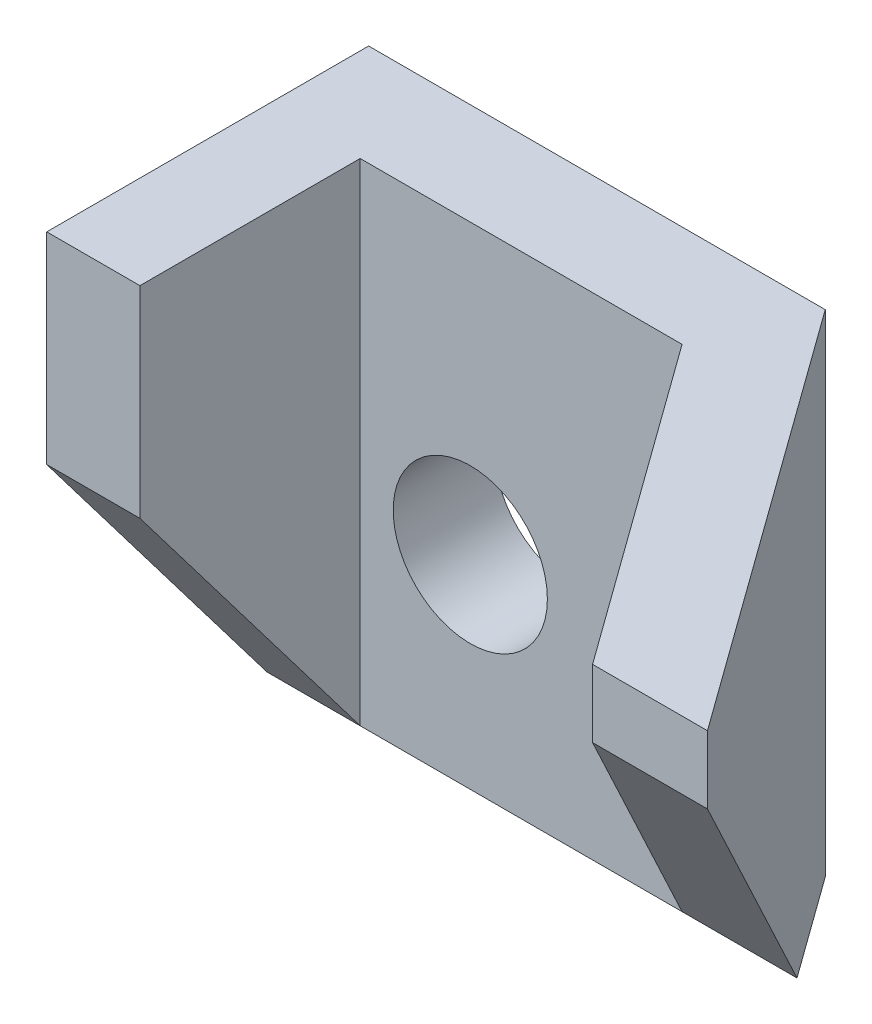
ISO-10303-21;
HEADER;
FILE_DESCRIPTION(('STEP AP214'),'2;1');
FILE_NAME('part.step','',(''),(''),'','','');
FILE_SCHEMA(('AUTOMOTIVE_DESIGN { 1 0 10303 214 1 1 1 1 }'));
ENDSEC;
DATA;
#1=APPLICATION_CONTEXT('core data for automotive mechanical design processes');
#2=APPLICATION_PROTOCOL_DEFINITION('international standard','automotive_design',2000,#1);
#3=PRODUCT_CONTEXT('',#1,'mechanical');
#4=PRODUCT('Part','Part','',(#3));
#5=PRODUCT_RELATED_PRODUCT_CATEGORY('part','',(#4));
#6=PRODUCT_DEFINITION_FORMATION('','',#4);
#7=PRODUCT_DEFINITION_CONTEXT('part definition',#1,'design');
#8=PRODUCT_DEFINITION('design','',#6,#7);
#9=PRODUCT_DEFINITION_SHAPE('','',#8);
#10=(LENGTH_UNIT() NAMED_UNIT(*) SI_UNIT(.MILLI.,.METRE.));
#11=(NAMED_UNIT(*) PLANE_ANGLE_UNIT() SI_UNIT($,.RADIAN.));
#12=(NAMED_UNIT(*) SI_UNIT($,.STERADIAN.) SOLID_ANGLE_UNIT());
#13=UNCERTAINTY_MEASURE_WITH_UNIT(LENGTH_MEASURE(1.E-05),#10,'distance_accuracy_value','');
#14=(GEOMETRIC_REPRESENTATION_CONTEXT(3) GLOBAL_UNCERTAINTY_ASSIGNED_CONTEXT((#13)) GLOBAL_UNIT_ASSIGNED_CONTEXT((#10,
#11,#12)) REPRESENTATION_CONTEXT('',''));
#15=CARTESIAN_POINT('',(0.,0.,0.));
#16=DIRECTION('',(0.,0.,1.));
#17=DIRECTION('',(1.,0.,0.));
#18=AXIS2_PLACEMENT_3D('',#15,#16,#17);
#19=CARTESIAN_POINT('',(0.,-12.,25.));
#20=DIRECTION('',(0.,-1.,0.));
#21=DIRECTION('',(1.,0.,0.));
#22=AXIS2_PLACEMENT_3D('',#19,#20,#21);
#23=PLANE('',#22);
#24=DIRECTION('',(0.,0.,-1.));
#25=VECTOR('',#24,1.);
#26=CARTESIAN_POINT('',(-12.,-12.,25.));
#27=LINE('',#26,#25);
#28=CARTESIAN_POINT('',(-12.,-12.,6.));
#29=VERTEX_POINT('',#28);
#30=CARTESIAN_POINT('',(-12.,-12.,0.));
#31=VERTEX_POINT('',#30);
#32=EDGE_CURVE('E11',#29,#31,#27,.T.);
#33=ORIENTED_EDGE('',*,*,#32,.T.);
#34=DIRECTION('',(1.,0.,0.));
#35=VECTOR('',#34,1.);
#36=CARTESIAN_POINT('',(0.,-12.,0.));
#37=LINE('',#36,#35);
#38=CARTESIAN_POINT('',(14.9519339128112,-12.,0.));
#39=VERTEX_POINT('',#38);
#40=EDGE_CURVE('E131',#31,#39,#37,.T.);
#41=ORIENTED_EDGE('',*,*,#40,.T.);
#42=DIRECTION('',(-0.585330910525227,0.,-0.810794502438015));
#43=VECTOR('',#42,1.);
#44=CARTESIAN_POINT('',(9.82921782204009,-12.,-7.09593491350215));
#45=LINE('',#44,#43);
#46=CARTESIAN_POINT('',(19.2834697737365,-12.,6.));
#47=VERTEX_POINT('',#46);
#48=EDGE_CURVE('E112',#47,#39,#45,.T.);
#49=ORIENTED_EDGE('',*,*,#48,.F.);
#50=DIRECTION('',(1.,0.,0.));
#51=VECTOR('',#50,1.);
#52=CARTESIAN_POINT('',(-43.4006369362152,-12.,6.));
#53=LINE('',#52,#51);
#54=CARTESIAN_POINT('',(12.5,-12.,6.));
#55=VERTEX_POINT('',#54);
#56=EDGE_CURVE('E121',#55,#47,#53,.T.);
#57=ORIENTED_EDGE('',*,*,#56,.F.);
#58=DIRECTION('',(1.,0.,0.));
#59=VECTOR('',#58,1.);
#60=CARTESIAN_POINT('',(0.,-12.,6.));
#61=LINE('',#60,#59);
#62=CARTESIAN_POINT('',(-6.49999999999999,-12.,6.));
#63=VERTEX_POINT('',#62);
#64=EDGE_CURVE('E187',#63,#55,#61,.T.);
#65=ORIENTED_EDGE('',*,*,#64,.F.);
#66=EDGE_CURVE('E127',#29,#63,#53,.T.);
#67=ORIENTED_EDGE('',*,*,#66,.F.);
#68=EDGE_LOOP('',(#33,#41,#49,#57,#65,#67));
#69=FACE_BOUND('',#68,.T.);
#70=ADVANCED_FACE('F36',(#69),#23,.T.);
#71=CARTESIAN_POINT('',(-12.,-12.,25.));
#72=DIRECTION('',(-1.,0.,0.));
#73=DIRECTION('',(0.,0.,-1.));
#74=AXIS2_PLACEMENT_3D('',#71,#72,#73);
#75=PLANE('',#74);
#76=DIRECTION('',(0.,1.,0.));
#77=VECTOR('',#76,1.);
#78=CARTESIAN_POINT('',(-12.,-12.,19.));
#79=LINE('',#78,#77);
#80=CARTESIAN_POINT('',(-12.,5.10526315789474,19.));
#81=VERTEX_POINT('',#80);
#82=CARTESIAN_POINT('',(-12.,17.,19.));
#83=VERTEX_POINT('',#82);
#84=EDGE_CURVE('E162',#81,#83,#79,.T.);
#85=ORIENTED_EDGE('',*,*,#84,.T.);
#86=DIRECTION('',(0.,0.,-1.));
#87=VECTOR('',#86,1.);
#88=CARTESIAN_POINT('',(-12.,17.,25.));
#89=LINE('',#88,#87);
#90=CARTESIAN_POINT('',(-12.,17.,0.));
#91=VERTEX_POINT('',#90);
#92=EDGE_CURVE('E45',#83,#91,#89,.T.);
#93=ORIENTED_EDGE('',*,*,#92,.T.);
#94=DIRECTION('',(0.,-1.,0.));
#95=VECTOR('',#94,1.);
#96=CARTESIAN_POINT('',(-12.,-12.,0.));
#97=LINE('',#96,#95);
#98=EDGE_CURVE('E152',#91,#31,#97,.T.);
#99=ORIENTED_EDGE('',*,*,#98,.T.);
#100=ORIENTED_EDGE('',*,*,#32,.F.);
#101=DIRECTION('',(0.,0.796162194123103,0.605083267533558));
#102=VECTOR('',#101,1.);
#103=CARTESIAN_POINT('',(-12.,-7.28397565922921,9.5841784989858));
#104=LINE('',#103,#102);
#105=EDGE_CURVE('E117',#29,#81,#104,.T.);
#106=ORIENTED_EDGE('',*,*,#105,.T.);
#107=EDGE_LOOP('',(#85,#93,#99,#100,#106));
#108=FACE_BOUND('',#107,.T.);
#109=ADVANCED_FACE('F158',(#108),#75,.T.);
#110=CARTESIAN_POINT('',(0.,0.,25.));
#111=DIRECTION('',(0.,0.,-1.));
#112=DIRECTION('',(1.,0.,0.));
#113=AXIS2_PLACEMENT_3D('',#110,#111,#112);
#114=PLANE('',#113);
#115=DIRECTION('',(1.,0.,0.));
#116=VECTOR('',#115,1.);
#117=CARTESIAN_POINT('',(-43.4006369362152,13.,25.));
#118=LINE('',#117,#116);
#119=CARTESIAN_POINT('',(26.2165302262635,13.,25.));
#120=VERTEX_POINT('',#119);
#121=CARTESIAN_POINT('',(33.,13.,25.));
#122=VERTEX_POINT('',#121);
#123=EDGE_CURVE('E128',#120,#122,#118,.T.);
#124=ORIENTED_EDGE('',*,*,#123,.T.);
#125=DIRECTION('',(0.,1.,0.));
#126=VECTOR('',#125,1.);
#127=CARTESIAN_POINT('',(33.,-12.,25.));
#128=LINE('',#127,#126);
#129=CARTESIAN_POINT('',(33.,17.,25.));
#130=VERTEX_POINT('',#129);
#131=EDGE_CURVE('E115',#122,#130,#128,.T.);
#132=ORIENTED_EDGE('',*,*,#131,.T.);
#133=DIRECTION('',(-1.,0.,0.));
#134=VECTOR('',#133,1.);
#135=CARTESIAN_POINT('',(33.,17.,25.));
#136=LINE('',#135,#134);
#137=CARTESIAN_POINT('',(26.2165302262635,17.,25.));
#138=VERTEX_POINT('',#137);
#139=EDGE_CURVE('E148',#130,#138,#136,.T.);
#140=ORIENTED_EDGE('',*,*,#139,.T.);
#141=DIRECTION('',(0.,1.,0.));
#142=VECTOR('',#141,1.);
#143=CARTESIAN_POINT('',(26.2165302262635,-12.,25.));
#144=LINE('',#143,#142);
#145=EDGE_CURVE('E178',#120,#138,#144,.T.);
#146=ORIENTED_EDGE('',*,*,#145,.F.);
#147=EDGE_LOOP('',(#124,#132,#140,#146));
#148=FACE_BOUND('',#147,.T.);
#149=ADVANCED_FACE('F201',(#148),#114,.F.);
#150=CARTESIAN_POINT('',(-6.49999999999999,-12.,0.));
#151=DIRECTION('',(-1.,0.,0.));
#152=DIRECTION('',(0.,-1.,0.));
#153=AXIS2_PLACEMENT_3D('',#150,#151,#152);
#154=PLANE('',#153);
#155=DIRECTION('',(0.,-0.796162194123103,-0.605083267533558));
#156=VECTOR('',#155,1.);
#157=CARTESIAN_POINT('',(-6.49999999999999,-14.8904665314402,3.80324543610548));
#158=LINE('',#157,#156);
#159=CARTESIAN_POINT('',(-6.49999999999999,5.10526315789474,19.));
#160=VERTEX_POINT('',#159);
#161=EDGE_CURVE('E193',#160,#63,#158,.T.);
#162=ORIENTED_EDGE('',*,*,#161,.T.);
#163=DIRECTION('',(0.,1.,0.));
#164=VECTOR('',#163,1.);
#165=CARTESIAN_POINT('',(-6.49999999999999,-12.,6.));
#166=LINE('',#165,#164);
#167=CARTESIAN_POINT('',(-6.5,17.,6.));
#168=VERTEX_POINT('',#167);
#169=EDGE_CURVE('E137',#63,#168,#166,.T.);
#170=ORIENTED_EDGE('',*,*,#169,.T.);
#171=DIRECTION('',(0.,0.,-1.));
#172=VECTOR('',#171,1.);
#173=CARTESIAN_POINT('',(-6.5,17.,0.));
#174=LINE('',#173,#172);
#175=CARTESIAN_POINT('',(-6.5,17.,19.));
#176=VERTEX_POINT('',#175);
#177=EDGE_CURVE('E185',#176,#168,#174,.T.);
#178=ORIENTED_EDGE('',*,*,#177,.F.);
#179=DIRECTION('',(0.,1.,0.));
#180=VECTOR('',#179,1.);
#181=CARTESIAN_POINT('',(-6.49999999999999,-12.,19.));
#182=LINE('',#181,#180);
#183=EDGE_CURVE('E177',#160,#176,#182,.T.);
#184=ORIENTED_EDGE('',*,*,#183,.F.);
#185=EDGE_LOOP('',(#162,#170,#178,#184));
#186=FACE_BOUND('',#185,.T.);
#187=ADVANCED_FACE('F211',(#186),#154,.F.);
#188=CARTESIAN_POINT('',(0.,-12.,19.));
#189=DIRECTION('',(0.,0.,-1.));
#190=DIRECTION('',(1.,0.,0.));
#191=AXIS2_PLACEMENT_3D('',#188,#189,#190);
#192=PLANE('',#191);
#193=DIRECTION('',(1.,0.,0.));
#194=VECTOR('',#193,1.);
#195=CARTESIAN_POINT('',(0.,5.10526315789474,19.));
#196=LINE('',#195,#194);
#197=EDGE_CURVE('E53',#81,#160,#196,.T.);
#198=ORIENTED_EDGE('',*,*,#197,.T.);
#199=ORIENTED_EDGE('',*,*,#183,.T.);
#200=DIRECTION('',(1.,0.,0.));
#201=VECTOR('',#200,1.);
#202=CARTESIAN_POINT('',(0.,17.,19.));
#203=LINE('',#202,#201);
#204=EDGE_CURVE('E165',#83,#176,#203,.T.);
#205=ORIENTED_EDGE('',*,*,#204,.F.);
#206=ORIENTED_EDGE('',*,*,#84,.F.);
#207=EDGE_LOOP('',(#198,#199,#205,#206));
#208=FACE_BOUND('',#207,.T.);
#209=ADVANCED_FACE('F175',(#208),#192,.F.);
#210=CARTESIAN_POINT('',(5.36984805863102,-12.,-3.8766149056134));
#211=DIRECTION('',(0.810794502438015,0.,-0.585330910525227));
#212=DIRECTION('',(0.585330910525227,0.,0.810794502438015));
#213=AXIS2_PLACEMENT_3D('',#210,#211,#212);
#214=PLANE('',#213);
#215=DIRECTION('',(0.400298286387528,0.72959101132782,0.554489168609143));
#216=VECTOR('',#215,1.);
#217=CARTESIAN_POINT('',(9.16524963985201,-18.0779772747536,1.38073727118729));
#218=LINE('',#217,#216);
#219=EDGE_CURVE('E123',#55,#120,#218,.T.);
#220=ORIENTED_EDGE('',*,*,#219,.T.);
#221=ORIENTED_EDGE('',*,*,#145,.T.);
#222=DIRECTION('',(0.585330910525227,0.,0.810794502438015));
#223=VECTOR('',#222,1.);
#224=CARTESIAN_POINT('',(5.36984805863101,17.,-3.8766149056134));
#225=LINE('',#224,#223);
#226=CARTESIAN_POINT('',(12.5,17.,6.));
#227=VERTEX_POINT('',#226);
#228=EDGE_CURVE('E189',#227,#138,#225,.T.);
#229=ORIENTED_EDGE('',*,*,#228,.F.);
#230=DIRECTION('',(0.,1.,0.));
#231=VECTOR('',#230,1.);
#232=CARTESIAN_POINT('',(12.5,-12.,6.));
#233=LINE('',#232,#231);
#234=EDGE_CURVE('E140',#55,#227,#233,.T.);
#235=ORIENTED_EDGE('',*,*,#234,.F.);
#236=EDGE_LOOP('',(#220,#221,#229,#235));
#237=FACE_BOUND('',#236,.T.);
#238=ADVANCED_FACE('F204',(#237),#214,.F.);
#239=CARTESIAN_POINT('',(9.82921782204009,-12.,-7.09593491350215));
#240=DIRECTION('',(-0.810794502438015,0.,0.585330910525227));
#241=DIRECTION('',(-0.585330910525227,0.,-0.810794502438015));
#242=AXIS2_PLACEMENT_3D('',#239,#240,#241);
#243=PLANE('',#242);
#244=DIRECTION('',(-0.400298286387528,-0.72959101132782,-0.554489168609143));
#245=VECTOR('',#244,1.);
#246=CARTESIAN_POINT('',(28.1739913433061,4.20402795552962,18.3150612462025));
#247=LINE('',#246,#245);
#248=EDGE_CURVE('E61',#122,#47,#247,.T.);
#249=ORIENTED_EDGE('',*,*,#248,.T.);
#250=ORIENTED_EDGE('',*,*,#48,.T.);
#251=DIRECTION('',(0.,1.,0.));
#252=VECTOR('',#251,1.);
#253=CARTESIAN_POINT('',(14.9519339128112,-12.,0.));
#254=LINE('',#253,#252);
#255=CARTESIAN_POINT('',(14.9519339128112,17.,0.));
#256=VERTEX_POINT('',#255);
#257=EDGE_CURVE('E132',#39,#256,#254,.T.);
#258=ORIENTED_EDGE('',*,*,#257,.T.);
#259=DIRECTION('',(-0.585330910525227,0.,-0.810794502438015));
#260=VECTOR('',#259,1.);
#261=CARTESIAN_POINT('',(9.82921782204009,17.,-7.09593491350215));
#262=LINE('',#261,#260);
#263=EDGE_CURVE('E133',#130,#256,#262,.T.);
#264=ORIENTED_EDGE('',*,*,#263,.F.);
#265=ORIENTED_EDGE('',*,*,#131,.F.);
#266=EDGE_LOOP('',(#249,#250,#258,#264,#265));
#267=FACE_BOUND('',#266,.T.);
#268=ADVANCED_FACE('F109',(#267),#243,.F.);
#269=CARTESIAN_POINT('',(33.,17.,25.));
#270=DIRECTION('',(0.,1.,0.));
#271=DIRECTION('',(-1.,0.,0.));
#272=AXIS2_PLACEMENT_3D('',#269,#270,#271);
#273=PLANE('',#272);
#274=ORIENTED_EDGE('',*,*,#204,.T.);
#275=ORIENTED_EDGE('',*,*,#177,.T.);
#276=DIRECTION('',(1.,0.,0.));
#277=VECTOR('',#276,1.);
#278=CARTESIAN_POINT('',(0.,17.,6.));
#279=LINE('',#278,#277);
#280=EDGE_CURVE('E191',#168,#227,#279,.T.);
#281=ORIENTED_EDGE('',*,*,#280,.T.);
#282=ORIENTED_EDGE('',*,*,#228,.T.);
#283=ORIENTED_EDGE('',*,*,#139,.F.);
#284=ORIENTED_EDGE('',*,*,#263,.T.);
#285=DIRECTION('',(-1.,0.,0.));
#286=VECTOR('',#285,1.);
#287=CARTESIAN_POINT('',(33.,17.,0.));
#288=LINE('',#287,#286);
#289=EDGE_CURVE('E146',#256,#91,#288,.T.);
#290=ORIENTED_EDGE('',*,*,#289,.T.);
#291=ORIENTED_EDGE('',*,*,#92,.F.);
#292=EDGE_LOOP('',(#274,#275,#281,#282,#283,#284,#290,#291));
#293=FACE_BOUND('',#292,.T.);
#294=ADVANCED_FACE('F38',(#293),#273,.T.);
#295=CARTESIAN_POINT('',(0.,0.,0.));
#296=DIRECTION('',(0.,0.,-1.));
#297=DIRECTION('',(1.,0.,0.));
#298=AXIS2_PLACEMENT_3D('',#295,#296,#297);
#299=PLANE('',#298);
#300=ORIENTED_EDGE('',*,*,#257,.F.);
#301=ORIENTED_EDGE('',*,*,#40,.F.);
#302=ORIENTED_EDGE('',*,*,#98,.F.);
#303=ORIENTED_EDGE('',*,*,#289,.F.);
#304=EDGE_LOOP('',(#300,#301,#302,#303));
#305=FACE_BOUND('',#304,.T.);
#306=CARTESIAN_POINT('',(0.,0.,0.));
#307=DIRECTION('',(0.,0.,1.));
#308=DIRECTION('',(1.,0.,0.));
#309=AXIS2_PLACEMENT_3D('',#306,#307,#308);
#310=CIRCLE('',#309,4.55);
#311=CARTESIAN_POINT('',(4.55,0.,0.));
#312=VERTEX_POINT('',#311);
#313=EDGE_CURVE('E143',#312,#312,#310,.T.);
#314=ORIENTED_EDGE('',*,*,#313,.T.);
#315=EDGE_LOOP('',(#314));
#316=FACE_BOUND('',#315,.T.);
#317=ADVANCED_FACE('F169',(#305,#316),#299,.T.);
#318=CARTESIAN_POINT('',(0.,0.,25.));
#319=DIRECTION('',(0.,0.,-1.));
#320=DIRECTION('',(1.,0.,0.));
#321=AXIS2_PLACEMENT_3D('',#318,#319,#320);
#322=CYLINDRICAL_SURFACE('',#321,4.55);
#323=CARTESIAN_POINT('',(0.,0.,6.));
#324=DIRECTION('',(0.,0.,1.));
#325=DIRECTION('',(1.,0.,0.));
#326=AXIS2_PLACEMENT_3D('',#323,#324,#325);
#327=CIRCLE('',#326,4.55);
#328=CARTESIAN_POINT('',(4.55,0.,6.));
#329=VERTEX_POINT('',#328);
#330=EDGE_CURVE('E40',#329,#329,#327,.F.);
#331=ORIENTED_EDGE('',*,*,#330,.F.);
#332=EDGE_LOOP('',(#331));
#333=FACE_BOUND('',#332,.T.);
#334=ORIENTED_EDGE('',*,*,#313,.F.);
#335=EDGE_LOOP('',(#334));
#336=FACE_BOUND('',#335,.T.);
#337=ADVANCED_FACE('F227',(#333,#336),#322,.F.);
#338=CARTESIAN_POINT('',(0.,-12.,6.));
#339=DIRECTION('',(0.,0.,-1.));
#340=DIRECTION('',(1.,0.,0.));
#341=AXIS2_PLACEMENT_3D('',#338,#339,#340);
#342=PLANE('',#341);
#343=ORIENTED_EDGE('',*,*,#280,.F.);
#344=ORIENTED_EDGE('',*,*,#169,.F.);
#345=ORIENTED_EDGE('',*,*,#64,.T.);
#346=ORIENTED_EDGE('',*,*,#234,.T.);
#347=EDGE_LOOP('',(#343,#344,#345,#346));
#348=FACE_BOUND('',#347,.T.);
#349=ORIENTED_EDGE('',*,*,#330,.T.);
#350=EDGE_LOOP('',(#349));
#351=FACE_BOUND('',#350,.T.);
#352=ADVANCED_FACE('F207',(#348,#351),#342,.F.);
#353=CARTESIAN_POINT('',(-43.4006369362152,-7.28397565922922,9.58417849898581));
#354=DIRECTION('',(0.,-0.605083267533558,0.796162194123103));
#355=DIRECTION('',(0.,0.796162194123103,0.605083267533558));
#356=AXIS2_PLACEMENT_3D('',#353,#354,#355);
#357=PLANE('',#356);
#358=ORIENTED_EDGE('',*,*,#219,.F.);
#359=ORIENTED_EDGE('',*,*,#56,.T.);
#360=ORIENTED_EDGE('',*,*,#248,.F.);
#361=ORIENTED_EDGE('',*,*,#123,.F.);
#362=EDGE_LOOP('',(#358,#359,#360,#361));
#363=FACE_BOUND('',#362,.T.);
#364=ADVANCED_FACE('F122',(#363),#357,.T.);
#365=ORIENTED_EDGE('',*,*,#161,.F.);
#366=ORIENTED_EDGE('',*,*,#197,.F.);
#367=ORIENTED_EDGE('',*,*,#105,.F.);
#368=ORIENTED_EDGE('',*,*,#66,.T.);
#369=EDGE_LOOP('',(#365,#366,#367,#368));
#370=FACE_BOUND('',#369,.T.);
#371=ADVANCED_FACE('F212',(#370),#357,.T.);
#372=CLOSED_SHELL('',(#70,#109,#149,#187,#209,#238,#268,#294,#317,#337,#352,#364,#371));
#373=MANIFOLD_SOLID_BREP('B2',#372);
#374=ADVANCED_BREP_SHAPE_REPRESENTATION('',(#18,#373),#14);
#375=SHAPE_DEFINITION_REPRESENTATION(#9,#374);
ENDSEC;
END-ISO-10303-21;
